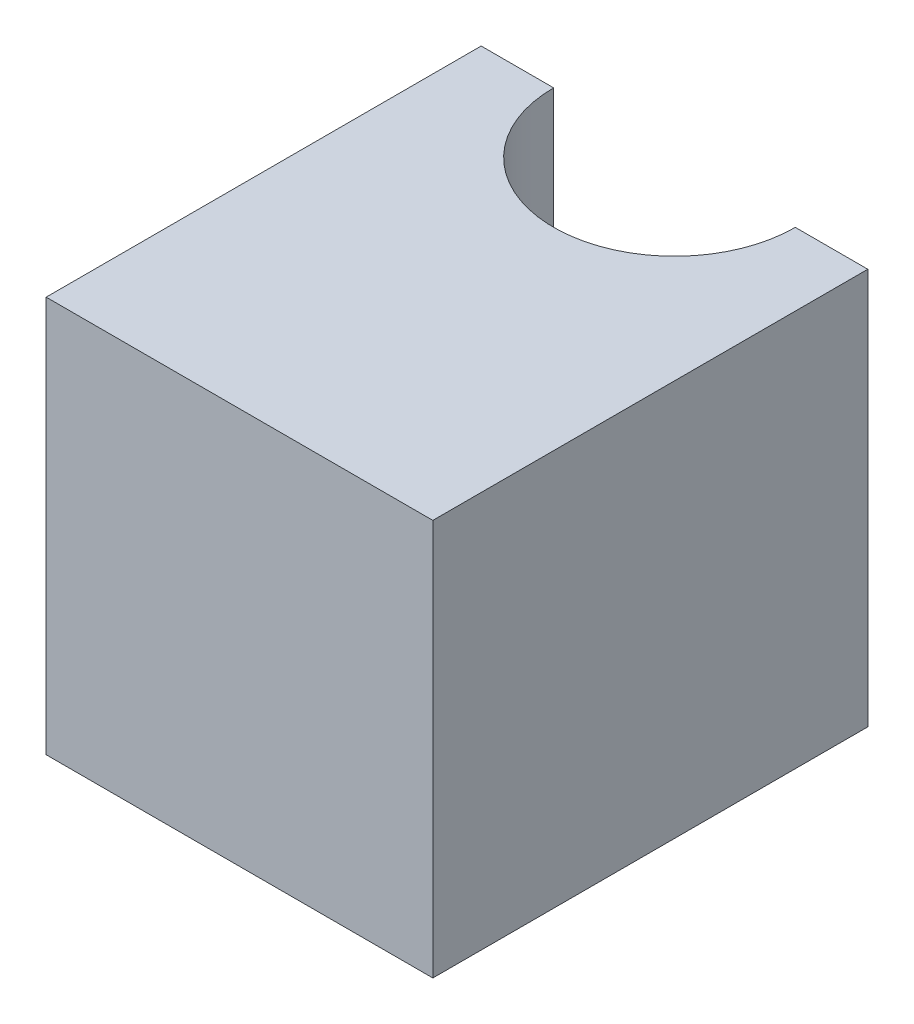
ISO-10303-21;
HEADER;
FILE_DESCRIPTION(('STEP AP214'),'2;1');
FILE_NAME('part.step','',(''),(''),'','','');
FILE_SCHEMA(('AUTOMOTIVE_DESIGN { 1 0 10303 214 1 1 1 1 }'));
ENDSEC;
DATA;
#1=APPLICATION_CONTEXT('core data for automotive mechanical design processes');
#2=APPLICATION_PROTOCOL_DEFINITION('international standard','automotive_design',2000,#1);
#3=PRODUCT_CONTEXT('',#1,'mechanical');
#4=PRODUCT('Part','Part','',(#3));
#5=PRODUCT_RELATED_PRODUCT_CATEGORY('part','',(#4));
#6=PRODUCT_DEFINITION_FORMATION('','',#4);
#7=PRODUCT_DEFINITION_CONTEXT('part definition',#1,'design');
#8=PRODUCT_DEFINITION('design','',#6,#7);
#9=PRODUCT_DEFINITION_SHAPE('','',#8);
#10=(LENGTH_UNIT() NAMED_UNIT(*) SI_UNIT(.MILLI.,.METRE.));
#11=(NAMED_UNIT(*) PLANE_ANGLE_UNIT() SI_UNIT($,.RADIAN.));
#12=(NAMED_UNIT(*) SI_UNIT($,.STERADIAN.) SOLID_ANGLE_UNIT());
#13=UNCERTAINTY_MEASURE_WITH_UNIT(LENGTH_MEASURE(1.E-05),#10,'distance_accuracy_value','');
#14=(GEOMETRIC_REPRESENTATION_CONTEXT(3) GLOBAL_UNCERTAINTY_ASSIGNED_CONTEXT((#13)) GLOBAL_UNIT_ASSIGNED_CONTEXT((#10,
#11,#12)) REPRESENTATION_CONTEXT('',''));
#15=CARTESIAN_POINT('',(0.,0.,0.));
#16=DIRECTION('',(0.,0.,1.));
#17=DIRECTION('',(1.,0.,0.));
#18=AXIS2_PLACEMENT_3D('',#15,#16,#17);
#19=CARTESIAN_POINT('',(1.9,0.,-5.2));
#20=DIRECTION('',(1.,0.,0.));
#21=DIRECTION('',(0.,0.,-1.));
#22=AXIS2_PLACEMENT_3D('',#19,#20,#21);
#23=PLANE('',#22);
#24=DIRECTION('',(0.,0.,1.));
#25=VECTOR('',#24,1.);
#26=CARTESIAN_POINT('',(1.9,0.82,-5.65));
#27=LINE('',#26,#25);
#28=CARTESIAN_POINT('',(1.9,0.82,-5.2));
#29=VERTEX_POINT('',#28);
#30=CARTESIAN_POINT('',(1.9,0.82,-6.1));
#31=VERTEX_POINT('',#30);
#32=EDGE_CURVE('E108',#29,#31,#27,.F.);
#33=ORIENTED_EDGE('',*,*,#32,.F.);
#34=DIRECTION('',(0.,1.,0.));
#35=VECTOR('',#34,1.);
#36=CARTESIAN_POINT('',(1.9,0.,-5.2));
#37=LINE('',#36,#35);
#38=CARTESIAN_POINT('',(1.9,0.,-5.2));
#39=VERTEX_POINT('',#38);
#40=EDGE_CURVE('E92',#39,#29,#37,.T.);
#41=ORIENTED_EDGE('',*,*,#40,.F.);
#42=DIRECTION('',(0.,0.,1.));
#43=VECTOR('',#42,1.);
#44=CARTESIAN_POINT('',(1.9,0.,-5.65));
#45=LINE('',#44,#43);
#46=CARTESIAN_POINT('',(1.9,0.,-6.1));
#47=VERTEX_POINT('',#46);
#48=EDGE_CURVE('E76',#39,#47,#45,.F.);
#49=ORIENTED_EDGE('',*,*,#48,.T.);
#50=DIRECTION('',(0.,1.,0.));
#51=VECTOR('',#50,1.);
#52=CARTESIAN_POINT('',(1.9,0.,-6.1));
#53=LINE('',#52,#51);
#54=EDGE_CURVE('E73',#31,#47,#53,.F.);
#55=ORIENTED_EDGE('',*,*,#54,.F.);
#56=EDGE_LOOP('',(#33,#41,#49,#55));
#57=FACE_BOUND('',#56,.T.);
#58=ADVANCED_FACE('F17',(#57),#23,.T.);
#59=CARTESIAN_POINT('',(1.9,0.,-6.1));
#60=DIRECTION('',(0.,0.,-1.));
#61=DIRECTION('',(-1.,0.,0.));
#62=AXIS2_PLACEMENT_3D('',#59,#60,#61);
#63=PLANE('',#62);
#64=DIRECTION('',(1.,0.,0.));
#65=VECTOR('',#64,1.);
#66=CARTESIAN_POINT('',(1.5,0.82,-6.1));
#67=LINE('',#66,#65);
#68=CARTESIAN_POINT('',(1.75,0.82,-6.1));
#69=VERTEX_POINT('',#68);
#70=EDGE_CURVE('E106',#31,#69,#67,.F.);
#71=ORIENTED_EDGE('',*,*,#70,.F.);
#72=ORIENTED_EDGE('',*,*,#54,.T.);
#73=DIRECTION('',(1.,0.,0.));
#74=VECTOR('',#73,1.);
#75=CARTESIAN_POINT('',(1.5,0.,-6.1));
#76=LINE('',#75,#74);
#77=CARTESIAN_POINT('',(1.75,0.,-6.1));
#78=VERTEX_POINT('',#77);
#79=EDGE_CURVE('E67',#47,#78,#76,.F.);
#80=ORIENTED_EDGE('',*,*,#79,.T.);
#81=DIRECTION('',(0.,1.,0.));
#82=VECTOR('',#81,1.);
#83=CARTESIAN_POINT('',(1.75,0.,-6.1));
#84=LINE('',#83,#82);
#85=EDGE_CURVE('E71',#78,#69,#84,.T.);
#86=ORIENTED_EDGE('',*,*,#85,.T.);
#87=EDGE_LOOP('',(#71,#72,#80,#86));
#88=FACE_BOUND('',#87,.T.);
#89=ADVANCED_FACE('F70',(#88),#63,.T.);
#90=CARTESIAN_POINT('',(1.5,0.,-6.1));
#91=DIRECTION('',(0.,1.,0.));
#92=DIRECTION('',(0.,0.,1.));
#93=AXIS2_PLACEMENT_3D('',#90,#91,#92);
#94=CYLINDRICAL_SURFACE('',#93,0.25);
#95=DIRECTION('',(0.,1.,0.));
#96=VECTOR('',#95,1.);
#97=CARTESIAN_POINT('',(1.25,0.,-6.1));
#98=LINE('',#97,#96);
#99=CARTESIAN_POINT('',(1.25,0.82,-6.1));
#100=VERTEX_POINT('',#99);
#101=CARTESIAN_POINT('',(1.25,0.,-6.1));
#102=VERTEX_POINT('',#101);
#103=EDGE_CURVE('E117',#100,#102,#98,.F.);
#104=ORIENTED_EDGE('',*,*,#103,.F.);
#105=CARTESIAN_POINT('',(1.5,0.82,-6.1));
#106=DIRECTION('',(0.,1.,0.));
#107=DIRECTION('',(0.,0.,1.));
#108=AXIS2_PLACEMENT_3D('',#105,#106,#107);
#109=CIRCLE('',#108,0.25);
#110=EDGE_CURVE('E83',#69,#100,#109,.F.);
#111=ORIENTED_EDGE('',*,*,#110,.F.);
#112=ORIENTED_EDGE('',*,*,#85,.F.);
#113=CARTESIAN_POINT('',(1.5,0.,-6.1));
#114=DIRECTION('',(0.,1.,0.));
#115=DIRECTION('',(0.,0.,1.));
#116=AXIS2_PLACEMENT_3D('',#113,#114,#115);
#117=CIRCLE('',#116,0.25);
#118=EDGE_CURVE('E20',#78,#102,#117,.F.);
#119=ORIENTED_EDGE('',*,*,#118,.T.);
#120=EDGE_LOOP('',(#104,#111,#112,#119));
#121=FACE_BOUND('',#120,.T.);
#122=ADVANCED_FACE('F81',(#121),#94,.F.);
#123=CARTESIAN_POINT('',(1.5,0.,-5.65));
#124=DIRECTION('',(0.,1.,0.));
#125=DIRECTION('',(0.,0.,1.));
#126=AXIS2_PLACEMENT_3D('',#123,#124,#125);
#127=PLANE('',#126);
#128=DIRECTION('',(0.,0.,1.));
#129=VECTOR('',#128,1.);
#130=CARTESIAN_POINT('',(1.1,0.,-6.1));
#131=LINE('',#130,#129);
#132=CARTESIAN_POINT('',(1.1,0.,-6.1));
#133=VERTEX_POINT('',#132);
#134=CARTESIAN_POINT('',(1.1,0.,-5.2));
#135=VERTEX_POINT('',#134);
#136=EDGE_CURVE('E119',#133,#135,#131,.T.);
#137=ORIENTED_EDGE('',*,*,#136,.F.);
#138=DIRECTION('',(-1.,0.,0.));
#139=VECTOR('',#138,1.);
#140=CARTESIAN_POINT('',(1.25,0.,-6.1));
#141=LINE('',#140,#139);
#142=EDGE_CURVE('E88',#102,#133,#141,.T.);
#143=ORIENTED_EDGE('',*,*,#142,.F.);
#144=ORIENTED_EDGE('',*,*,#118,.F.);
#145=ORIENTED_EDGE('',*,*,#79,.F.);
#146=ORIENTED_EDGE('',*,*,#48,.F.);
#147=DIRECTION('',(1.,0.,0.));
#148=VECTOR('',#147,1.);
#149=CARTESIAN_POINT('',(1.1,0.,-5.2));
#150=LINE('',#149,#148);
#151=EDGE_CURVE('E90',#135,#39,#150,.T.);
#152=ORIENTED_EDGE('',*,*,#151,.F.);
#153=EDGE_LOOP('',(#137,#143,#144,#145,#146,#152));
#154=FACE_BOUND('',#153,.T.);
#155=ADVANCED_FACE('F86',(#154),#127,.F.);
#156=CARTESIAN_POINT('',(1.1,0.,-5.2));
#157=DIRECTION('',(0.,0.,1.));
#158=DIRECTION('',(1.,0.,0.));
#159=AXIS2_PLACEMENT_3D('',#156,#157,#158);
#160=PLANE('',#159);
#161=DIRECTION('',(1.,0.,0.));
#162=VECTOR('',#161,1.);
#163=CARTESIAN_POINT('',(1.5,0.82,-5.2));
#164=LINE('',#163,#162);
#165=CARTESIAN_POINT('',(1.1,0.82,-5.2));
#166=VERTEX_POINT('',#165);
#167=EDGE_CURVE('E96',#166,#29,#164,.T.);
#168=ORIENTED_EDGE('',*,*,#167,.F.);
#169=DIRECTION('',(0.,1.,0.));
#170=VECTOR('',#169,1.);
#171=CARTESIAN_POINT('',(1.1,0.,-5.2));
#172=LINE('',#171,#170);
#173=EDGE_CURVE('E127',#135,#166,#172,.T.);
#174=ORIENTED_EDGE('',*,*,#173,.F.);
#175=ORIENTED_EDGE('',*,*,#151,.T.);
#176=ORIENTED_EDGE('',*,*,#40,.T.);
#177=EDGE_LOOP('',(#168,#174,#175,#176));
#178=FACE_BOUND('',#177,.T.);
#179=ADVANCED_FACE('F149',(#178),#160,.T.);
#180=CARTESIAN_POINT('',(1.5,0.82,-5.65));
#181=DIRECTION('',(0.,1.,0.));
#182=DIRECTION('',(0.,0.,1.));
#183=AXIS2_PLACEMENT_3D('',#180,#181,#182);
#184=PLANE('',#183);
#185=DIRECTION('',(-1.,0.,0.));
#186=VECTOR('',#185,1.);
#187=CARTESIAN_POINT('',(1.25,0.82,-6.1));
#188=LINE('',#187,#186);
#189=CARTESIAN_POINT('',(1.1,0.82,-6.1));
#190=VERTEX_POINT('',#189);
#191=EDGE_CURVE('E35',#190,#100,#188,.F.);
#192=ORIENTED_EDGE('',*,*,#191,.F.);
#193=DIRECTION('',(0.,0.,1.));
#194=VECTOR('',#193,1.);
#195=CARTESIAN_POINT('',(1.1,0.82,-6.1));
#196=LINE('',#195,#194);
#197=EDGE_CURVE('E26',#166,#190,#196,.F.);
#198=ORIENTED_EDGE('',*,*,#197,.F.);
#199=ORIENTED_EDGE('',*,*,#167,.T.);
#200=ORIENTED_EDGE('',*,*,#32,.T.);
#201=ORIENTED_EDGE('',*,*,#70,.T.);
#202=ORIENTED_EDGE('',*,*,#110,.T.);
#203=EDGE_LOOP('',(#192,#198,#199,#200,#201,#202));
#204=FACE_BOUND('',#203,.T.);
#205=ADVANCED_FACE('F152',(#204),#184,.T.);
#206=CARTESIAN_POINT('',(1.25,0.,-6.1));
#207=DIRECTION('',(0.,0.,-1.));
#208=DIRECTION('',(-1.,0.,0.));
#209=AXIS2_PLACEMENT_3D('',#206,#207,#208);
#210=PLANE('',#209);
#211=ORIENTED_EDGE('',*,*,#191,.T.);
#212=ORIENTED_EDGE('',*,*,#103,.T.);
#213=ORIENTED_EDGE('',*,*,#142,.T.);
#214=DIRECTION('',(0.,1.,0.));
#215=VECTOR('',#214,1.);
#216=CARTESIAN_POINT('',(1.1,0.,-6.1));
#217=LINE('',#216,#215);
#218=EDGE_CURVE('E11',#190,#133,#217,.F.);
#219=ORIENTED_EDGE('',*,*,#218,.F.);
#220=EDGE_LOOP('',(#211,#212,#213,#219));
#221=FACE_BOUND('',#220,.T.);
#222=ADVANCED_FACE('F154',(#221),#210,.T.);
#223=CARTESIAN_POINT('',(1.1,0.,-6.1));
#224=DIRECTION('',(-1.,0.,0.));
#225=DIRECTION('',(0.,0.,1.));
#226=AXIS2_PLACEMENT_3D('',#223,#224,#225);
#227=PLANE('',#226);
#228=ORIENTED_EDGE('',*,*,#197,.T.);
#229=ORIENTED_EDGE('',*,*,#218,.T.);
#230=ORIENTED_EDGE('',*,*,#136,.T.);
#231=ORIENTED_EDGE('',*,*,#173,.T.);
#232=EDGE_LOOP('',(#228,#229,#230,#231));
#233=FACE_BOUND('',#232,.T.);
#234=ADVANCED_FACE('F148',(#233),#227,.T.);
#235=CLOSED_SHELL('',(#58,#89,#122,#155,#179,#205,#222,#234));
#236=MANIFOLD_SOLID_BREP('B1',#235);
#237=ADVANCED_BREP_SHAPE_REPRESENTATION('',(#18,#236),#14);
#238=SHAPE_DEFINITION_REPRESENTATION(#9,#237);
ENDSEC;
END-ISO-10303-21;
